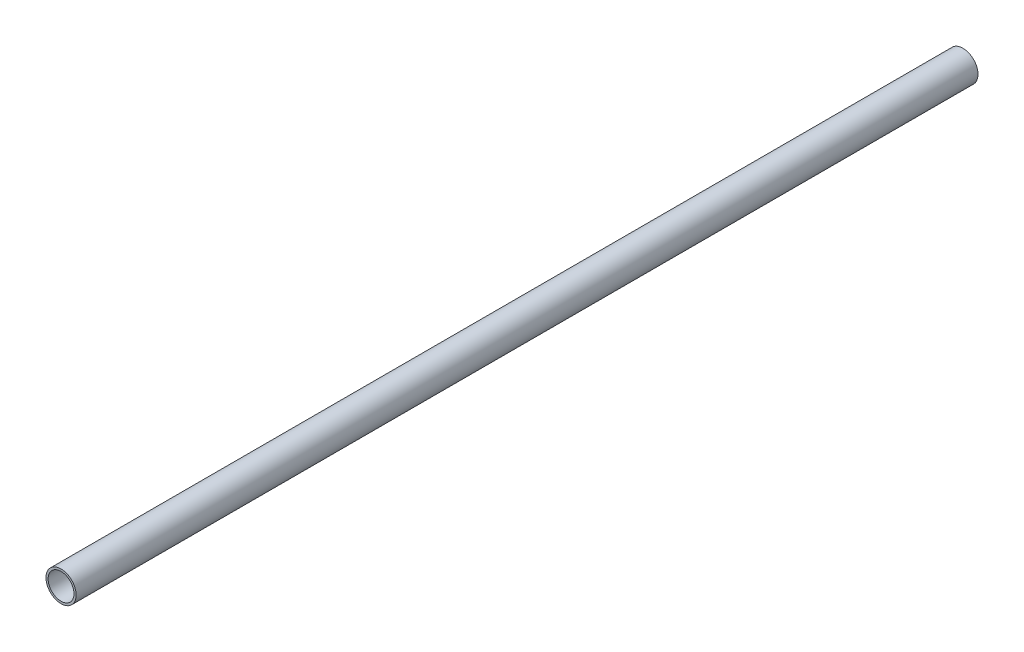
ISO-10303-21;
HEADER;
FILE_DESCRIPTION(('STEP AP214'),'2;1');
FILE_NAME('part.step','',(''),(''),'','','');
FILE_SCHEMA(('AUTOMOTIVE_DESIGN { 1 0 10303 214 1 1 1 1 }'));
ENDSEC;
DATA;
#1=APPLICATION_CONTEXT('core data for automotive mechanical design processes');
#2=APPLICATION_PROTOCOL_DEFINITION('international standard','automotive_design',2000,#1);
#3=PRODUCT_CONTEXT('',#1,'mechanical');
#4=PRODUCT('Part','Part','',(#3));
#5=PRODUCT_RELATED_PRODUCT_CATEGORY('part','',(#4));
#6=PRODUCT_DEFINITION_FORMATION('','',#4);
#7=PRODUCT_DEFINITION_CONTEXT('part definition',#1,'design');
#8=PRODUCT_DEFINITION('design','',#6,#7);
#9=PRODUCT_DEFINITION_SHAPE('','',#8);
#10=(LENGTH_UNIT() NAMED_UNIT(*) SI_UNIT(.MILLI.,.METRE.));
#11=(NAMED_UNIT(*) PLANE_ANGLE_UNIT() SI_UNIT($,.RADIAN.));
#12=(NAMED_UNIT(*) SI_UNIT($,.STERADIAN.) SOLID_ANGLE_UNIT());
#13=UNCERTAINTY_MEASURE_WITH_UNIT(LENGTH_MEASURE(1.E-05),#10,'distance_accuracy_value','');
#14=(GEOMETRIC_REPRESENTATION_CONTEXT(3) GLOBAL_UNCERTAINTY_ASSIGNED_CONTEXT((#13)) GLOBAL_UNIT_ASSIGNED_CONTEXT((#10,
#11,#12)) REPRESENTATION_CONTEXT('',''));
#15=CARTESIAN_POINT('',(0.,0.,0.));
#16=DIRECTION('',(0.,0.,1.));
#17=DIRECTION('',(1.,0.,0.));
#18=AXIS2_PLACEMENT_3D('',#15,#16,#17);
#19=CARTESIAN_POINT('',(0.,0.,116.32565));
#20=DIRECTION('',(0.,0.,1.));
#21=DIRECTION('',(1.,0.,0.));
#22=AXIS2_PLACEMENT_3D('',#19,#20,#21);
#23=PLANE('',#22);
#24=CARTESIAN_POINT('',(0.,0.,116.32565));
#25=DIRECTION('',(0.,0.,1.));
#26=DIRECTION('',(1.,0.,0.));
#27=AXIS2_PLACEMENT_3D('',#24,#25,#26);
#28=CIRCLE('',#27,3.889375);
#29=CARTESIAN_POINT('',(3.889375,0.,116.32565));
#30=VERTEX_POINT('',#29);
#31=EDGE_CURVE('E10',#30,#30,#28,.T.);
#32=ORIENTED_EDGE('',*,*,#31,.T.);
#33=EDGE_LOOP('',(#32));
#34=FACE_BOUND('',#33,.T.);
#35=CARTESIAN_POINT('',(0.,0.,116.32565));
#36=DIRECTION('',(0.,0.,1.));
#37=DIRECTION('',(1.,0.,0.));
#38=AXIS2_PLACEMENT_3D('',#35,#36,#37);
#39=CIRCLE('',#38,3.33375);
#40=CARTESIAN_POINT('',(3.33375,0.,116.32565));
#41=VERTEX_POINT('',#40);
#42=EDGE_CURVE('E51',#41,#41,#39,.T.);
#43=ORIENTED_EDGE('',*,*,#42,.F.);
#44=EDGE_LOOP('',(#43));
#45=FACE_BOUND('',#44,.T.);
#46=ADVANCED_FACE('F38',(#34,#45),#23,.T.);
#47=CARTESIAN_POINT('',(0.,0.,-116.32565));
#48=DIRECTION('',(0.,0.,1.));
#49=DIRECTION('',(1.,0.,0.));
#50=AXIS2_PLACEMENT_3D('',#47,#48,#49);
#51=PLANE('',#50);
#52=CARTESIAN_POINT('',(0.,0.,-116.32565));
#53=DIRECTION('',(0.,0.,1.));
#54=DIRECTION('',(1.,0.,0.));
#55=AXIS2_PLACEMENT_3D('',#52,#53,#54);
#56=CIRCLE('',#55,3.889375);
#57=CARTESIAN_POINT('',(3.889375,0.,-116.32565));
#58=VERTEX_POINT('',#57);
#59=EDGE_CURVE('E42',#58,#58,#56,.T.);
#60=ORIENTED_EDGE('',*,*,#59,.F.);
#61=EDGE_LOOP('',(#60));
#62=FACE_BOUND('',#61,.T.);
#63=CARTESIAN_POINT('',(0.,0.,-116.32565));
#64=DIRECTION('',(0.,0.,1.));
#65=DIRECTION('',(1.,0.,0.));
#66=AXIS2_PLACEMENT_3D('',#63,#64,#65);
#67=CIRCLE('',#66,3.33375);
#68=CARTESIAN_POINT('',(3.33375,0.,-116.32565));
#69=VERTEX_POINT('',#68);
#70=EDGE_CURVE('E53',#69,#69,#67,.T.);
#71=ORIENTED_EDGE('',*,*,#70,.T.);
#72=EDGE_LOOP('',(#71));
#73=FACE_BOUND('',#72,.T.);
#74=ADVANCED_FACE('F65',(#62,#73),#51,.F.);
#75=CARTESIAN_POINT('',(0.,0.,116.32565));
#76=DIRECTION('',(0.,0.,-1.));
#77=DIRECTION('',(-1.,0.,0.));
#78=AXIS2_PLACEMENT_3D('',#75,#76,#77);
#79=CYLINDRICAL_SURFACE('',#78,3.889375);
#80=ORIENTED_EDGE('',*,*,#31,.F.);
#81=EDGE_LOOP('',(#80));
#82=FACE_BOUND('',#81,.T.);
#83=ORIENTED_EDGE('',*,*,#59,.T.);
#84=EDGE_LOOP('',(#83));
#85=FACE_BOUND('',#84,.T.);
#86=ADVANCED_FACE('F40',(#82,#85),#79,.T.);
#87=CARTESIAN_POINT('',(0.,0.,116.32565));
#88=DIRECTION('',(0.,0.,-1.));
#89=DIRECTION('',(-1.,0.,0.));
#90=AXIS2_PLACEMENT_3D('',#87,#88,#89);
#91=CYLINDRICAL_SURFACE('',#90,3.33375);
#92=ORIENTED_EDGE('',*,*,#42,.T.);
#93=EDGE_LOOP('',(#92));
#94=FACE_BOUND('',#93,.T.);
#95=ORIENTED_EDGE('',*,*,#70,.F.);
#96=EDGE_LOOP('',(#95));
#97=FACE_BOUND('',#96,.T.);
#98=ADVANCED_FACE('F61',(#94,#97),#91,.F.);
#99=CLOSED_SHELL('',(#46,#74,#86,#98));
#100=MANIFOLD_SOLID_BREP('B2',#99);
#101=ADVANCED_BREP_SHAPE_REPRESENTATION('',(#18,#100),#14);
#102=SHAPE_DEFINITION_REPRESENTATION(#9,#101);
ENDSEC;
END-ISO-10303-21;
